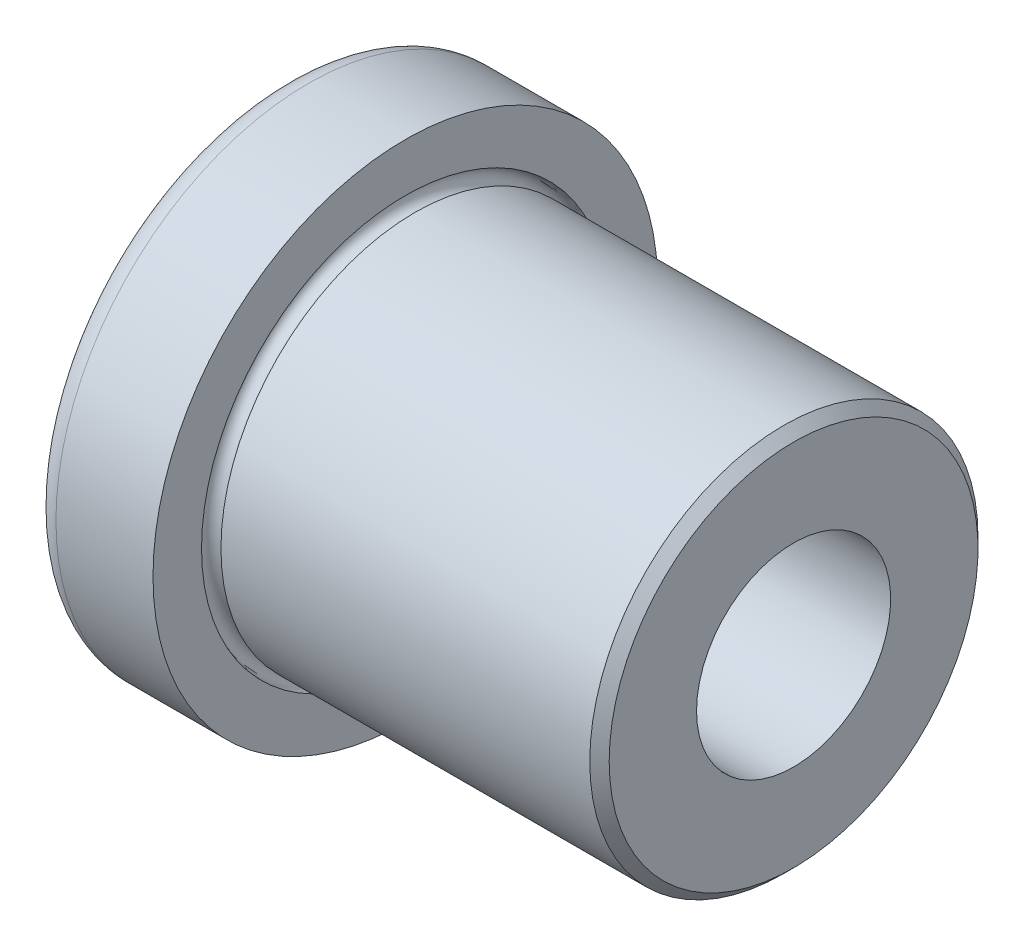
ISO-10303-21;
HEADER;
FILE_DESCRIPTION(('STEP AP214'),'2;1');
FILE_NAME('part.step','',(''),(''),'','','');
FILE_SCHEMA(('AUTOMOTIVE_DESIGN { 1 0 10303 214 1 1 1 1 }'));
ENDSEC;
DATA;
#1=APPLICATION_CONTEXT('core data for automotive mechanical design processes');
#2=APPLICATION_PROTOCOL_DEFINITION('international standard','automotive_design',2000,#1);
#3=PRODUCT_CONTEXT('',#1,'mechanical');
#4=PRODUCT('Part','Part','',(#3));
#5=PRODUCT_RELATED_PRODUCT_CATEGORY('part','',(#4));
#6=PRODUCT_DEFINITION_FORMATION('','',#4);
#7=PRODUCT_DEFINITION_CONTEXT('part definition',#1,'design');
#8=PRODUCT_DEFINITION('design','',#6,#7);
#9=PRODUCT_DEFINITION_SHAPE('','',#8);
#10=(LENGTH_UNIT() NAMED_UNIT(*) SI_UNIT(.MILLI.,.METRE.));
#11=(NAMED_UNIT(*) PLANE_ANGLE_UNIT() SI_UNIT($,.RADIAN.));
#12=(NAMED_UNIT(*) SI_UNIT($,.STERADIAN.) SOLID_ANGLE_UNIT());
#13=UNCERTAINTY_MEASURE_WITH_UNIT(LENGTH_MEASURE(1.E-05),#10,'distance_accuracy_value','');
#14=(GEOMETRIC_REPRESENTATION_CONTEXT(3) GLOBAL_UNCERTAINTY_ASSIGNED_CONTEXT((#13)) GLOBAL_UNIT_ASSIGNED_CONTEXT((#10,
#11,#12)) REPRESENTATION_CONTEXT('',''));
#15=CARTESIAN_POINT('',(0.,0.,0.));
#16=DIRECTION('',(0.,0.,1.));
#17=DIRECTION('',(1.,0.,0.));
#18=AXIS2_PLACEMENT_3D('',#15,#16,#17);
#19=CARTESIAN_POINT('',(3.9624,8.255,0.));
#20=DIRECTION('',(1.,0.,0.));
#21=DIRECTION('',(0.,0.,-1.));
#22=AXIS2_PLACEMENT_3D('',#19,#20,#21);
#23=PLANE('',#22);
#24=CARTESIAN_POINT('',(3.9624,0.,0.));
#25=DIRECTION('',(-1.,0.,0.));
#26=DIRECTION('',(0.,0.,1.));
#27=AXIS2_PLACEMENT_3D('',#24,#25,#26);
#28=CIRCLE('',#27,6.6675);
#29=CARTESIAN_POINT('',(3.9624,0.,6.6675));
#30=VERTEX_POINT('',#29);
#31=EDGE_CURVE('E64',#30,#30,#28,.T.);
#32=ORIENTED_EDGE('',*,*,#31,.T.);
#33=EDGE_LOOP('',(#32));
#34=FACE_BOUND('',#33,.T.);
#35=CARTESIAN_POINT('',(3.9624,0.,0.));
#36=DIRECTION('',(-1.,0.,0.));
#37=DIRECTION('',(0.,0.,1.));
#38=AXIS2_PLACEMENT_3D('',#35,#36,#37);
#39=CIRCLE('',#38,8.255);
#40=CARTESIAN_POINT('',(3.9624,0.,8.255));
#41=VERTEX_POINT('',#40);
#42=EDGE_CURVE('E10',#41,#41,#39,.T.);
#43=ORIENTED_EDGE('',*,*,#42,.F.);
#44=EDGE_LOOP('',(#43));
#45=FACE_BOUND('',#44,.T.);
#46=ADVANCED_FACE('F30',(#34,#45),#23,.T.);
#47=CARTESIAN_POINT('',(0.,0.,0.));
#48=DIRECTION('',(-1.,0.,0.));
#49=DIRECTION('',(0.,0.,1.));
#50=AXIS2_PLACEMENT_3D('',#47,#48,#49);
#51=CYLINDRICAL_SURFACE('',#50,8.255);
#52=ORIENTED_EDGE('',*,*,#42,.T.);
#53=EDGE_LOOP('',(#52));
#54=FACE_BOUND('',#53,.T.);
#55=CARTESIAN_POINT('',(0.7874,0.,0.));
#56=DIRECTION('',(-1.,0.,0.));
#57=DIRECTION('',(0.,0.,1.));
#58=AXIS2_PLACEMENT_3D('',#55,#56,#57);
#59=CIRCLE('',#58,8.255);
#60=CARTESIAN_POINT('',(0.7874,0.,8.255));
#61=VERTEX_POINT('',#60);
#62=EDGE_CURVE('E36',#61,#61,#59,.T.);
#63=ORIENTED_EDGE('',*,*,#62,.F.);
#64=EDGE_LOOP('',(#63));
#65=FACE_BOUND('',#64,.T.);
#66=ADVANCED_FACE('F82',(#54,#65),#51,.T.);
#67=CARTESIAN_POINT('',(0.7874,0.,0.));
#68=DIRECTION('',(-1.,0.,0.));
#69=DIRECTION('',(0.,0.,1.));
#70=AXIS2_PLACEMENT_3D('',#67,#68,#69);
#71=TOROIDAL_SURFACE('',#70,7.4676,0.7874);
#72=CARTESIAN_POINT('',(0.,0.,0.));
#73=DIRECTION('',(-1.,0.,0.));
#74=DIRECTION('',(0.,0.,1.));
#75=AXIS2_PLACEMENT_3D('',#72,#73,#74);
#76=CIRCLE('',#75,7.4676);
#77=CARTESIAN_POINT('',(0.,0.,7.4676));
#78=VERTEX_POINT('',#77);
#79=EDGE_CURVE('E40',#78,#78,#76,.T.);
#80=ORIENTED_EDGE('',*,*,#79,.F.);
#81=EDGE_LOOP('',(#80));
#82=FACE_BOUND('',#81,.T.);
#83=ORIENTED_EDGE('',*,*,#62,.T.);
#84=EDGE_LOOP('',(#83));
#85=FACE_BOUND('',#84,.T.);
#86=ADVANCED_FACE('F86',(#82,#85),#71,.T.);
#87=CARTESIAN_POINT('',(0.,3.96239999999999,0.));
#88=DIRECTION('',(-1.,0.,0.));
#89=DIRECTION('',(0.,0.,1.));
#90=AXIS2_PLACEMENT_3D('',#87,#88,#89);
#91=PLANE('',#90);
#92=ORIENTED_EDGE('',*,*,#79,.T.);
#93=EDGE_LOOP('',(#92));
#94=FACE_BOUND('',#93,.T.);
#95=CARTESIAN_POINT('',(0.,0.,0.));
#96=DIRECTION('',(-1.,0.,0.));
#97=DIRECTION('',(0.,0.,1.));
#98=AXIS2_PLACEMENT_3D('',#95,#96,#97);
#99=CIRCLE('',#98,3.96239999999999);
#100=CARTESIAN_POINT('',(0.,0.,3.96239999999999));
#101=VERTEX_POINT('',#100);
#102=EDGE_CURVE('E44',#101,#101,#99,.T.);
#103=ORIENTED_EDGE('',*,*,#102,.F.);
#104=EDGE_LOOP('',(#103));
#105=FACE_BOUND('',#104,.T.);
#106=ADVANCED_FACE('F90',(#94,#105),#91,.T.);
#107=CARTESIAN_POINT('',(0.787400000000001,0.,0.));
#108=DIRECTION('',(-1.,0.,0.));
#109=DIRECTION('',(0.,0.,1.));
#110=AXIS2_PLACEMENT_3D('',#107,#108,#109);
#111=TOROIDAL_SURFACE('',#110,3.96239999999999,0.787399999999999);
#112=CARTESIAN_POINT('',(0.787400000000001,0.,0.));
#113=DIRECTION('',(-1.,0.,0.));
#114=DIRECTION('',(0.,0.,1.));
#115=AXIS2_PLACEMENT_3D('',#112,#113,#114);
#116=CIRCLE('',#115,3.175);
#117=CARTESIAN_POINT('',(0.787400000000001,0.,3.175));
#118=VERTEX_POINT('',#117);
#119=EDGE_CURVE('E49',#118,#118,#116,.T.);
#120=ORIENTED_EDGE('',*,*,#119,.F.);
#121=EDGE_LOOP('',(#120));
#122=FACE_BOUND('',#121,.T.);
#123=ORIENTED_EDGE('',*,*,#102,.T.);
#124=EDGE_LOOP('',(#123));
#125=FACE_BOUND('',#124,.T.);
#126=ADVANCED_FACE('F97',(#122,#125),#111,.T.);
#127=CARTESIAN_POINT('',(0.,0.,0.));
#128=DIRECTION('',(-1.,0.,0.));
#129=DIRECTION('',(0.,0.,1.));
#130=AXIS2_PLACEMENT_3D('',#127,#128,#129);
#131=CYLINDRICAL_SURFACE('',#130,3.175);
#132=ORIENTED_EDGE('',*,*,#119,.T.);
#133=EDGE_LOOP('',(#132));
#134=FACE_BOUND('',#133,.T.);
#135=CARTESIAN_POINT('',(16.6624,0.,0.));
#136=DIRECTION('',(-1.,0.,0.));
#137=DIRECTION('',(0.,0.,1.));
#138=AXIS2_PLACEMENT_3D('',#135,#136,#137);
#139=CIRCLE('',#138,3.175);
#140=CARTESIAN_POINT('',(16.6624,0.,3.175));
#141=VERTEX_POINT('',#140);
#142=EDGE_CURVE('E52',#141,#141,#139,.T.);
#143=ORIENTED_EDGE('',*,*,#142,.F.);
#144=EDGE_LOOP('',(#143));
#145=FACE_BOUND('',#144,.T.);
#146=ADVANCED_FACE('F101',(#134,#145),#131,.F.);
#147=CARTESIAN_POINT('',(16.6624,6.0325,0.));
#148=DIRECTION('',(1.,0.,0.));
#149=DIRECTION('',(0.,0.,-1.));
#150=AXIS2_PLACEMENT_3D('',#147,#148,#149);
#151=PLANE('',#150);
#152=ORIENTED_EDGE('',*,*,#142,.T.);
#153=EDGE_LOOP('',(#152));
#154=FACE_BOUND('',#153,.T.);
#155=CARTESIAN_POINT('',(16.6624,0.,0.));
#156=DIRECTION('',(-1.,0.,0.));
#157=DIRECTION('',(0.,0.,1.));
#158=AXIS2_PLACEMENT_3D('',#155,#156,#157);
#159=CIRCLE('',#158,6.0325);
#160=CARTESIAN_POINT('',(16.6624,0.,6.0325));
#161=VERTEX_POINT('',#160);
#162=EDGE_CURVE('E55',#161,#161,#159,.T.);
#163=ORIENTED_EDGE('',*,*,#162,.F.);
#164=EDGE_LOOP('',(#163));
#165=FACE_BOUND('',#164,.T.);
#166=ADVANCED_FACE('F105',(#154,#165),#151,.T.);
#167=CARTESIAN_POINT('',(16.3449,0.,0.));
#168=DIRECTION('',(-1.,0.,0.));
#169=DIRECTION('',(0.,0.,1.));
#170=AXIS2_PLACEMENT_3D('',#167,#168,#169);
#171=CONICAL_SURFACE('',#170,6.35,0.785398163397451);
#172=ORIENTED_EDGE('',*,*,#162,.T.);
#173=EDGE_LOOP('',(#172));
#174=FACE_BOUND('',#173,.T.);
#175=CARTESIAN_POINT('',(16.3449,0.,0.));
#176=DIRECTION('',(-1.,0.,0.));
#177=DIRECTION('',(0.,0.,1.));
#178=AXIS2_PLACEMENT_3D('',#175,#176,#177);
#179=CIRCLE('',#178,6.35);
#180=CARTESIAN_POINT('',(16.3449,0.,6.35));
#181=VERTEX_POINT('',#180);
#182=EDGE_CURVE('E58',#181,#181,#179,.T.);
#183=ORIENTED_EDGE('',*,*,#182,.F.);
#184=EDGE_LOOP('',(#183));
#185=FACE_BOUND('',#184,.T.);
#186=ADVANCED_FACE('F78',(#174,#185),#171,.T.);
#187=CARTESIAN_POINT('',(0.,0.,0.));
#188=DIRECTION('',(-1.,0.,0.));
#189=DIRECTION('',(0.,0.,1.));
#190=AXIS2_PLACEMENT_3D('',#187,#188,#189);
#191=CYLINDRICAL_SURFACE('',#190,6.35);
#192=ORIENTED_EDGE('',*,*,#182,.T.);
#193=EDGE_LOOP('',(#192));
#194=FACE_BOUND('',#193,.T.);
#195=CARTESIAN_POINT('',(4.2799,0.,0.));
#196=DIRECTION('',(-1.,0.,0.));
#197=DIRECTION('',(0.,0.,1.));
#198=AXIS2_PLACEMENT_3D('',#195,#196,#197);
#199=CIRCLE('',#198,6.35);
#200=CARTESIAN_POINT('',(4.2799,0.,6.35));
#201=VERTEX_POINT('',#200);
#202=EDGE_CURVE('E61',#201,#201,#199,.T.);
#203=ORIENTED_EDGE('',*,*,#202,.F.);
#204=EDGE_LOOP('',(#203));
#205=FACE_BOUND('',#204,.T.);
#206=ADVANCED_FACE('F72',(#194,#205),#191,.T.);
#207=CARTESIAN_POINT('',(3.9624,0.,0.));
#208=DIRECTION('',(-1.,0.,0.));
#209=DIRECTION('',(0.,0.,1.));
#210=AXIS2_PLACEMENT_3D('',#207,#208,#209);
#211=TOROIDAL_SURFACE('',#210,6.35,0.3175);
#212=ORIENTED_EDGE('',*,*,#202,.T.);
#213=EDGE_LOOP('',(#212));
#214=FACE_BOUND('',#213,.T.);
#215=ORIENTED_EDGE('',*,*,#31,.F.);
#216=EDGE_LOOP('',(#215));
#217=FACE_BOUND('',#216,.T.);
#218=ADVANCED_FACE('F70',(#214,#217),#211,.F.);
#219=CLOSED_SHELL('',(#46,#66,#86,#106,#126,#146,#166,#186,#206,#218));
#220=MANIFOLD_SOLID_BREP('B2',#219);
#221=ADVANCED_BREP_SHAPE_REPRESENTATION('',(#18,#220),#14);
#222=SHAPE_DEFINITION_REPRESENTATION(#9,#221);
ENDSEC;
END-ISO-10303-21;
